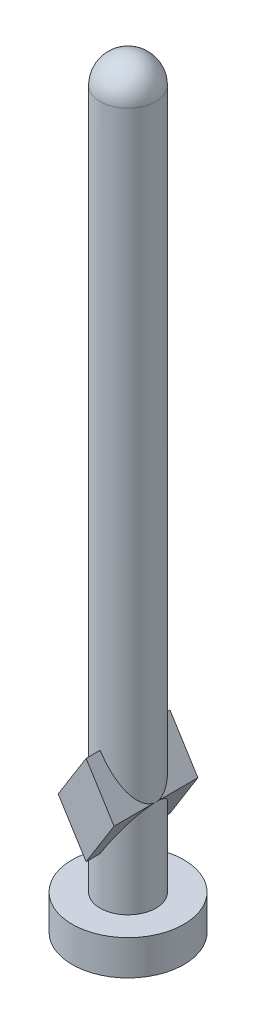
ISO-10303-21;
HEADER;
FILE_DESCRIPTION(('STEP AP214'),'2;1');
FILE_NAME('part.step','',(''),(''),'','','');
FILE_SCHEMA(('AUTOMOTIVE_DESIGN { 1 0 10303 214 1 1 1 1 }'));
ENDSEC;
DATA;
#1=APPLICATION_CONTEXT('core data for automotive mechanical design processes');
#2=APPLICATION_PROTOCOL_DEFINITION('international standard','automotive_design',2000,#1);
#3=PRODUCT_CONTEXT('',#1,'mechanical');
#4=PRODUCT('Part','Part','',(#3));
#5=PRODUCT_RELATED_PRODUCT_CATEGORY('part','',(#4));
#6=PRODUCT_DEFINITION_FORMATION('','',#4);
#7=PRODUCT_DEFINITION_CONTEXT('part definition',#1,'design');
#8=PRODUCT_DEFINITION('design','',#6,#7);
#9=PRODUCT_DEFINITION_SHAPE('','',#8);
#10=(LENGTH_UNIT() NAMED_UNIT(*) SI_UNIT(.MILLI.,.METRE.));
#11=(NAMED_UNIT(*) PLANE_ANGLE_UNIT() SI_UNIT($,.RADIAN.));
#12=(NAMED_UNIT(*) SI_UNIT($,.STERADIAN.) SOLID_ANGLE_UNIT());
#13=UNCERTAINTY_MEASURE_WITH_UNIT(LENGTH_MEASURE(1.E-05),#10,'distance_accuracy_value','');
#14=(GEOMETRIC_REPRESENTATION_CONTEXT(3) GLOBAL_UNCERTAINTY_ASSIGNED_CONTEXT((#13)) GLOBAL_UNIT_ASSIGNED_CONTEXT((#10,
#11,#12)) REPRESENTATION_CONTEXT('',''));
#15=CARTESIAN_POINT('',(0.,0.,0.));
#16=DIRECTION('',(0.,0.,1.));
#17=DIRECTION('',(1.,0.,0.));
#18=AXIS2_PLACEMENT_3D('',#15,#16,#17);
#19=CARTESIAN_POINT('',(0.,100.,0.));
#20=DIRECTION('',(0.,-1.,0.));
#21=DIRECTION('',(0.,0.,-1.));
#22=AXIS2_PLACEMENT_3D('',#19,#20,#21);
#23=CYLINDRICAL_SURFACE('',#22,4.);
#24=CARTESIAN_POINT('',(0.,6.75940967701019,0.));
#25=DIRECTION('',(-0.848236351407123,-0.529617873708518,0.));
#26=DIRECTION('',(0.529617873708518,-0.848236351407123,0.));
#27=AXIS2_PLACEMENT_3D('',#24,#25,#26);
#28=ELLIPSE('',#27,7.55261519402847,4.);
#29=CARTESIAN_POINT('',(-4.,13.1658124327749,0.));
#30=VERTEX_POINT('',#29);
#31=CARTESIAN_POINT('',(0.,6.75940967701025,-4.));
#32=VERTEX_POINT('',#31);
#33=EDGE_CURVE('E157',#30,#32,#28,.T.);
#34=ORIENTED_EDGE('',*,*,#33,.T.);
#35=CARTESIAN_POINT('',(0.,6.7594096770103,0.));
#36=DIRECTION('',(0.848236351407119,-0.529617873708525,0.));
#37=DIRECTION('',(-0.529617873708525,-0.848236351407119,0.));
#38=AXIS2_PLACEMENT_3D('',#35,#36,#37);
#39=ELLIPSE('',#38,7.55261519402837,4.);
#40=CARTESIAN_POINT('',(4.,13.1658124327749,0.));
#41=VERTEX_POINT('',#40);
#42=EDGE_CURVE('E50',#32,#41,#39,.T.);
#43=ORIENTED_EDGE('',*,*,#42,.T.);
#44=CARTESIAN_POINT('',(0.,6.75940967701025,4.));
#45=VERTEX_POINT('',#44);
#46=EDGE_CURVE('E160',#41,#45,#39,.T.);
#47=ORIENTED_EDGE('',*,*,#46,.T.);
#48=EDGE_CURVE('E159',#45,#30,#28,.T.);
#49=ORIENTED_EDGE('',*,*,#48,.T.);
#50=EDGE_LOOP('',(#34,#43,#47,#49));
#51=FACE_BOUND('',#50,.T.);
#52=CARTESIAN_POINT('',(0.,0.,0.));
#53=DIRECTION('',(0.,-1.,0.));
#54=DIRECTION('',(0.,0.,-1.));
#55=AXIS2_PLACEMENT_3D('',#52,#53,#54);
#56=CIRCLE('',#55,4.);
#57=CARTESIAN_POINT('',(0.,0.,-4.));
#58=VERTEX_POINT('',#57);
#59=EDGE_CURVE('E149',#58,#58,#56,.T.);
#60=ORIENTED_EDGE('',*,*,#59,.F.);
#61=EDGE_LOOP('',(#60));
#62=FACE_BOUND('',#61,.T.);
#63=ADVANCED_FACE('F33',(#51,#62),#23,.T.);
#64=CARTESIAN_POINT('',(0.,0.,0.));
#65=DIRECTION('',(0.,-1.,0.));
#66=DIRECTION('',(0.,0.,-1.));
#67=AXIS2_PLACEMENT_3D('',#64,#65,#66);
#68=PLANE('',#67);
#69=CARTESIAN_POINT('',(0.,0.,0.));
#70=DIRECTION('',(0.,-1.,0.));
#71=DIRECTION('',(0.,0.,-1.));
#72=AXIS2_PLACEMENT_3D('',#69,#70,#71);
#73=CIRCLE('',#72,8.);
#74=CARTESIAN_POINT('',(0.,0.,-8.));
#75=VERTEX_POINT('',#74);
#76=EDGE_CURVE('E138',#75,#75,#73,.T.);
#77=ORIENTED_EDGE('',*,*,#76,.F.);
#78=EDGE_LOOP('',(#77));
#79=FACE_BOUND('',#78,.T.);
#80=ORIENTED_EDGE('',*,*,#59,.T.);
#81=EDGE_LOOP('',(#80));
#82=FACE_BOUND('',#81,.T.);
#83=ADVANCED_FACE('F196',(#79,#82),#68,.F.);
#84=CARTESIAN_POINT('',(0.,-5.,0.));
#85=DIRECTION('',(0.,1.,0.));
#86=DIRECTION('',(0.,0.,1.));
#87=AXIS2_PLACEMENT_3D('',#84,#85,#86);
#88=CYLINDRICAL_SURFACE('',#87,8.);
#89=CARTESIAN_POINT('',(0.,-5.,0.));
#90=DIRECTION('',(0.,-1.,0.));
#91=DIRECTION('',(0.,0.,-1.));
#92=AXIS2_PLACEMENT_3D('',#89,#90,#91);
#93=CIRCLE('',#92,8.);
#94=CARTESIAN_POINT('',(0.,-5.,-8.));
#95=VERTEX_POINT('',#94);
#96=EDGE_CURVE('E146',#95,#95,#93,.T.);
#97=ORIENTED_EDGE('',*,*,#96,.F.);
#98=EDGE_LOOP('',(#97));
#99=FACE_BOUND('',#98,.T.);
#100=ORIENTED_EDGE('',*,*,#76,.T.);
#101=EDGE_LOOP('',(#100));
#102=FACE_BOUND('',#101,.T.);
#103=ADVANCED_FACE('F200',(#99,#102),#88,.T.);
#104=CARTESIAN_POINT('',(0.,-5.,0.));
#105=DIRECTION('',(0.,-1.,0.));
#106=DIRECTION('',(0.,0.,-1.));
#107=AXIS2_PLACEMENT_3D('',#104,#105,#106);
#108=PLANE('',#107);
#109=ORIENTED_EDGE('',*,*,#96,.T.);
#110=EDGE_LOOP('',(#109));
#111=FACE_BOUND('',#110,.T.);
#112=ADVANCED_FACE('F220',(#111),#108,.T.);
#113=CARTESIAN_POINT('',(0.,0.,-6.));
#114=DIRECTION('',(0.,0.,1.));
#115=DIRECTION('',(1.,0.,0.));
#116=AXIS2_PLACEMENT_3D('',#113,#114,#115);
#117=PLANE('',#116);
#118=DIRECTION('',(-0.529617873708525,-0.848236351407118,0.));
#119=VECTOR('',#118,1.);
#120=CARTESIAN_POINT('',(0.,19.5722151885395,-6.));
#121=LINE('',#120,#119);
#122=CARTESIAN_POINT('',(0.,19.5722151885395,-6.));
#123=VERTEX_POINT('',#122);
#124=CARTESIAN_POINT('',(-4.,13.1658124327749,-6.));
#125=VERTEX_POINT('',#124);
#126=EDGE_CURVE('E125',#123,#125,#121,.T.);
#127=ORIENTED_EDGE('',*,*,#126,.F.);
#128=DIRECTION('',(-0.529617873708518,0.848236351407123,0.));
#129=VECTOR('',#128,1.);
#130=CARTESIAN_POINT('',(4.,13.1658124327749,-6.));
#131=LINE('',#130,#129);
#132=CARTESIAN_POINT('',(4.,13.1658124327749,-6.));
#133=VERTEX_POINT('',#132);
#134=EDGE_CURVE('E105',#133,#123,#131,.T.);
#135=ORIENTED_EDGE('',*,*,#134,.F.);
#136=DIRECTION('',(0.529617873708525,0.848236351407119,0.));
#137=VECTOR('',#136,1.);
#138=CARTESIAN_POINT('',(0.,6.75940967701025,-6.));
#139=LINE('',#138,#137);
#140=CARTESIAN_POINT('',(0.,6.75940967701025,-6.));
#141=VERTEX_POINT('',#140);
#142=EDGE_CURVE('E130',#141,#133,#139,.T.);
#143=ORIENTED_EDGE('',*,*,#142,.F.);
#144=DIRECTION('',(0.529617873708518,-0.848236351407123,0.));
#145=VECTOR('',#144,1.);
#146=CARTESIAN_POINT('',(-4.,13.1658124327749,-6.));
#147=LINE('',#146,#145);
#148=EDGE_CURVE('E128',#125,#141,#147,.T.);
#149=ORIENTED_EDGE('',*,*,#148,.F.);
#150=EDGE_LOOP('',(#127,#135,#143,#149));
#151=FACE_BOUND('',#150,.T.);
#152=ADVANCED_FACE('F175',(#151),#117,.F.);
#153=CARTESIAN_POINT('',(-4.,13.1658124327749,-6.));
#154=DIRECTION('',(-0.848236351407123,-0.529617873708518,0.));
#155=DIRECTION('',(0.529617873708518,-0.848236351407123,0.));
#156=AXIS2_PLACEMENT_3D('',#153,#154,#155);
#157=PLANE('',#156);
#158=ORIENTED_EDGE('',*,*,#33,.F.);
#159=DIRECTION('',(0.,0.,1.));
#160=VECTOR('',#159,1.);
#161=CARTESIAN_POINT('',(-4.,13.1658124327749,-6.));
#162=LINE('',#161,#160);
#163=EDGE_CURVE('E104',#125,#30,#162,.T.);
#164=ORIENTED_EDGE('',*,*,#163,.F.);
#165=ORIENTED_EDGE('',*,*,#148,.T.);
#166=DIRECTION('',(0.,0.,1.));
#167=VECTOR('',#166,1.);
#168=CARTESIAN_POINT('',(0.,6.75940967701025,-6.));
#169=LINE('',#168,#167);
#170=EDGE_CURVE('E58',#141,#32,#169,.T.);
#171=ORIENTED_EDGE('',*,*,#170,.T.);
#172=EDGE_LOOP('',(#158,#164,#165,#171));
#173=FACE_BOUND('',#172,.T.);
#174=ADVANCED_FACE('F177',(#173),#157,.T.);
#175=CARTESIAN_POINT('',(0.,6.75940967701025,-6.));
#176=DIRECTION('',(0.848236351407119,-0.529617873708525,0.));
#177=DIRECTION('',(0.529617873708525,0.848236351407119,0.));
#178=AXIS2_PLACEMENT_3D('',#175,#176,#177);
#179=PLANE('',#178);
#180=ORIENTED_EDGE('',*,*,#42,.F.);
#181=ORIENTED_EDGE('',*,*,#170,.F.);
#182=ORIENTED_EDGE('',*,*,#142,.T.);
#183=DIRECTION('',(0.,0.,1.));
#184=VECTOR('',#183,1.);
#185=CARTESIAN_POINT('',(4.,13.1658124327749,-6.));
#186=LINE('',#185,#184);
#187=EDGE_CURVE('E140',#133,#41,#186,.T.);
#188=ORIENTED_EDGE('',*,*,#187,.T.);
#189=EDGE_LOOP('',(#180,#181,#182,#188));
#190=FACE_BOUND('',#189,.T.);
#191=ADVANCED_FACE('F191',(#190),#179,.T.);
#192=CARTESIAN_POINT('',(4.,13.1658124327749,-6.));
#193=DIRECTION('',(0.848236351407123,0.529617873708518,0.));
#194=DIRECTION('',(-0.529617873708518,0.848236351407123,0.));
#195=AXIS2_PLACEMENT_3D('',#192,#193,#194);
#196=PLANE('',#195);
#197=CARTESIAN_POINT('',(0.,19.5722151885396,0.));
#198=DIRECTION('',(0.848236351407123,0.529617873708518,0.));
#199=DIRECTION('',(0.529617873708518,-0.848236351407123,0.));
#200=AXIS2_PLACEMENT_3D('',#197,#198,#199);
#201=ELLIPSE('',#200,7.55261519402846,4.);
#202=CARTESIAN_POINT('',(0.,19.5722151885395,-4.));
#203=VERTEX_POINT('',#202);
#204=EDGE_CURVE('E11',#41,#203,#201,.T.);
#205=ORIENTED_EDGE('',*,*,#204,.F.);
#206=ORIENTED_EDGE('',*,*,#187,.F.);
#207=ORIENTED_EDGE('',*,*,#134,.T.);
#208=DIRECTION('',(0.,0.,1.));
#209=VECTOR('',#208,1.);
#210=CARTESIAN_POINT('',(0.,19.5722151885395,-6.));
#211=LINE('',#210,#209);
#212=EDGE_CURVE('E135',#123,#203,#211,.T.);
#213=ORIENTED_EDGE('',*,*,#212,.T.);
#214=EDGE_LOOP('',(#205,#206,#207,#213));
#215=FACE_BOUND('',#214,.T.);
#216=ADVANCED_FACE('F171',(#215),#196,.T.);
#217=CARTESIAN_POINT('',(0.,19.5722151885395,-6.));
#218=DIRECTION('',(-0.848236351407119,0.529617873708525,0.));
#219=DIRECTION('',(-0.529617873708525,-0.848236351407119,0.));
#220=AXIS2_PLACEMENT_3D('',#217,#218,#219);
#221=PLANE('',#220);
#222=CARTESIAN_POINT('',(0.,19.5722151885395,0.));
#223=DIRECTION('',(-0.848236351407119,0.529617873708525,0.));
#224=DIRECTION('',(-0.529617873708525,-0.848236351407119,0.));
#225=AXIS2_PLACEMENT_3D('',#222,#223,#224);
#226=ELLIPSE('',#225,7.55261519402836,4.);
#227=EDGE_CURVE('E42',#203,#30,#226,.T.);
#228=ORIENTED_EDGE('',*,*,#227,.F.);
#229=ORIENTED_EDGE('',*,*,#212,.F.);
#230=ORIENTED_EDGE('',*,*,#126,.T.);
#231=ORIENTED_EDGE('',*,*,#163,.T.);
#232=EDGE_LOOP('',(#228,#229,#230,#231));
#233=FACE_BOUND('',#232,.T.);
#234=ADVANCED_FACE('F167',(#233),#221,.T.);
#235=CARTESIAN_POINT('',(0.,19.5722151885395,4.));
#236=VERTEX_POINT('',#235);
#237=EDGE_CURVE('E37',#30,#236,#226,.T.);
#238=ORIENTED_EDGE('',*,*,#237,.F.);
#239=CARTESIAN_POINT('',(-4.,13.1658124327749,6.));
#240=VERTEX_POINT('',#239);
#241=EDGE_CURVE('E96',#30,#240,#162,.T.);
#242=ORIENTED_EDGE('',*,*,#241,.T.);
#243=DIRECTION('',(-0.529617873708525,-0.848236351407118,0.));
#244=VECTOR('',#243,1.);
#245=CARTESIAN_POINT('',(0.,19.5722151885395,6.));
#246=LINE('',#245,#244);
#247=CARTESIAN_POINT('',(0.,19.5722151885395,6.));
#248=VERTEX_POINT('',#247);
#249=EDGE_CURVE('E101',#248,#240,#246,.T.);
#250=ORIENTED_EDGE('',*,*,#249,.F.);
#251=EDGE_CURVE('E139',#236,#248,#211,.T.);
#252=ORIENTED_EDGE('',*,*,#251,.F.);
#253=EDGE_LOOP('',(#238,#242,#250,#252));
#254=FACE_BOUND('',#253,.T.);
#255=ADVANCED_FACE('F98',(#254),#221,.T.);
#256=EDGE_CURVE('E43',#236,#41,#201,.T.);
#257=ORIENTED_EDGE('',*,*,#256,.F.);
#258=ORIENTED_EDGE('',*,*,#251,.T.);
#259=DIRECTION('',(-0.529617873708518,0.848236351407123,0.));
#260=VECTOR('',#259,1.);
#261=CARTESIAN_POINT('',(4.,13.1658124327749,6.));
#262=LINE('',#261,#260);
#263=CARTESIAN_POINT('',(4.,13.1658124327749,6.));
#264=VERTEX_POINT('',#263);
#265=EDGE_CURVE('E120',#264,#248,#262,.T.);
#266=ORIENTED_EDGE('',*,*,#265,.F.);
#267=EDGE_CURVE('E143',#41,#264,#186,.T.);
#268=ORIENTED_EDGE('',*,*,#267,.F.);
#269=EDGE_LOOP('',(#257,#258,#266,#268));
#270=FACE_BOUND('',#269,.T.);
#271=ADVANCED_FACE('F183',(#270),#196,.T.);
#272=ORIENTED_EDGE('',*,*,#46,.F.);
#273=ORIENTED_EDGE('',*,*,#267,.T.);
#274=DIRECTION('',(0.529617873708525,0.848236351407119,0.));
#275=VECTOR('',#274,1.);
#276=CARTESIAN_POINT('',(0.,6.75940967701025,6.));
#277=LINE('',#276,#275);
#278=CARTESIAN_POINT('',(0.,6.75940967701025,6.));
#279=VERTEX_POINT('',#278);
#280=EDGE_CURVE('E115',#279,#264,#277,.T.);
#281=ORIENTED_EDGE('',*,*,#280,.F.);
#282=EDGE_CURVE('E111',#45,#279,#169,.T.);
#283=ORIENTED_EDGE('',*,*,#282,.F.);
#284=EDGE_LOOP('',(#272,#273,#281,#283));
#285=FACE_BOUND('',#284,.T.);
#286=ADVANCED_FACE('F180',(#285),#179,.T.);
#287=ORIENTED_EDGE('',*,*,#48,.F.);
#288=ORIENTED_EDGE('',*,*,#282,.T.);
#289=DIRECTION('',(0.529617873708518,-0.848236351407123,0.));
#290=VECTOR('',#289,1.);
#291=CARTESIAN_POINT('',(-4.,13.1658124327749,6.));
#292=LINE('',#291,#290);
#293=EDGE_CURVE('E108',#240,#279,#292,.T.);
#294=ORIENTED_EDGE('',*,*,#293,.F.);
#295=ORIENTED_EDGE('',*,*,#241,.F.);
#296=EDGE_LOOP('',(#287,#288,#294,#295));
#297=FACE_BOUND('',#296,.T.);
#298=ADVANCED_FACE('F109',(#297),#157,.T.);
#299=CARTESIAN_POINT('',(0.,0.,6.));
#300=DIRECTION('',(0.,0.,1.));
#301=DIRECTION('',(1.,0.,0.));
#302=AXIS2_PLACEMENT_3D('',#299,#300,#301);
#303=PLANE('',#302);
#304=ORIENTED_EDGE('',*,*,#249,.T.);
#305=ORIENTED_EDGE('',*,*,#293,.T.);
#306=ORIENTED_EDGE('',*,*,#280,.T.);
#307=ORIENTED_EDGE('',*,*,#265,.T.);
#308=EDGE_LOOP('',(#304,#305,#306,#307));
#309=FACE_BOUND('',#308,.T.);
#310=ADVANCED_FACE('F118',(#309),#303,.T.);
#311=CARTESIAN_POINT('',(0.,100.,0.));
#312=DIRECTION('',(0.,0.,1.));
#313=DIRECTION('',(1.,0.,0.));
#314=AXIS2_PLACEMENT_3D('',#311,#312,#313);
#315=SPHERICAL_SURFACE('',#314,4.);
#316=CARTESIAN_POINT('',(0.,100.,0.));
#317=DIRECTION('',(0.,1.,0.));
#318=DIRECTION('',(0.,0.,1.));
#319=AXIS2_PLACEMENT_3D('',#316,#317,#318);
#320=SPHERICAL_SURFACE('',#319,4.);
#321=CARTESIAN_POINT('',(0.,100.,0.));
#322=DIRECTION('',(0.,1.,0.));
#323=DIRECTION('',(0.,0.,1.));
#324=AXIS2_PLACEMENT_3D('',#321,#322,#323);
#325=CIRCLE('',#324,4.);
#326=CARTESIAN_POINT('',(0.,100.,4.));
#327=VERTEX_POINT('',#326);
#328=EDGE_CURVE('E154',#327,#327,#325,.T.);
#329=ORIENTED_EDGE('',*,*,#328,.T.);
#330=EDGE_LOOP('',(#329));
#331=FACE_BOUND('',#330,.T.);
#332=ADVANCED_FACE('F35',(#331),#320,.T.);
#333=ORIENTED_EDGE('',*,*,#328,.F.);
#334=EDGE_LOOP('',(#333));
#335=FACE_BOUND('',#334,.T.);
#336=ORIENTED_EDGE('',*,*,#256,.T.);
#337=ORIENTED_EDGE('',*,*,#204,.T.);
#338=ORIENTED_EDGE('',*,*,#227,.T.);
#339=ORIENTED_EDGE('',*,*,#237,.T.);
#340=EDGE_LOOP('',(#336,#337,#338,#339));
#341=FACE_BOUND('',#340,.T.);
#342=ADVANCED_FACE('F164',(#335,#341),#23,.T.);
#343=CLOSED_SHELL('',(#63,#83,#103,#112,#152,#174,#191,#216,#234,#255,#271,#286,#298,#310,#332,#342));
#344=MANIFOLD_SOLID_BREP('B2',#343);
#345=ADVANCED_BREP_SHAPE_REPRESENTATION('',(#18,#344),#14);
#346=SHAPE_DEFINITION_REPRESENTATION(#9,#345);
ENDSEC;
END-ISO-10303-21;
